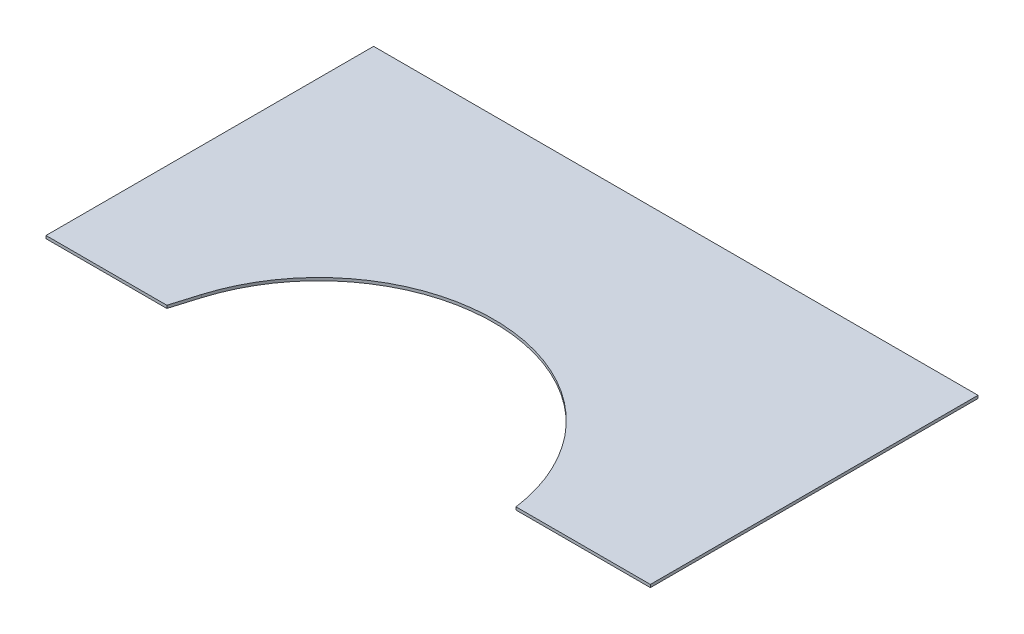
ISO-10303-21;
HEADER;
FILE_DESCRIPTION(('STEP AP214'),'2;1');
FILE_NAME('part.step','',(''),(''),'','','');
FILE_SCHEMA(('AUTOMOTIVE_DESIGN { 1 0 10303 214 1 1 1 1 }'));
ENDSEC;
DATA;
#1=APPLICATION_CONTEXT('core data for automotive mechanical design processes');
#2=APPLICATION_PROTOCOL_DEFINITION('international standard','automotive_design',2000,#1);
#3=PRODUCT_CONTEXT('',#1,'mechanical');
#4=PRODUCT('Part','Part','',(#3));
#5=PRODUCT_RELATED_PRODUCT_CATEGORY('part','',(#4));
#6=PRODUCT_DEFINITION_FORMATION('','',#4);
#7=PRODUCT_DEFINITION_CONTEXT('part definition',#1,'design');
#8=PRODUCT_DEFINITION('design','',#6,#7);
#9=PRODUCT_DEFINITION_SHAPE('','',#8);
#10=(LENGTH_UNIT() NAMED_UNIT(*) SI_UNIT(.MILLI.,.METRE.));
#11=(NAMED_UNIT(*) PLANE_ANGLE_UNIT() SI_UNIT($,.RADIAN.));
#12=(NAMED_UNIT(*) SI_UNIT($,.STERADIAN.) SOLID_ANGLE_UNIT());
#13=UNCERTAINTY_MEASURE_WITH_UNIT(LENGTH_MEASURE(1.E-05),#10,'distance_accuracy_value','');
#14=(GEOMETRIC_REPRESENTATION_CONTEXT(3) GLOBAL_UNCERTAINTY_ASSIGNED_CONTEXT((#13)) GLOBAL_UNIT_ASSIGNED_CONTEXT((#10,
#11,#12)) REPRESENTATION_CONTEXT('',''));
#15=CARTESIAN_POINT('',(0.,0.,0.));
#16=DIRECTION('',(0.,0.,1.));
#17=DIRECTION('',(1.,0.,0.));
#18=AXIS2_PLACEMENT_3D('',#15,#16,#17);
#19=CARTESIAN_POINT('',(0.,3.175,0.));
#20=DIRECTION('',(0.,0.,-1.));
#21=DIRECTION('',(-1.,0.,0.));
#22=AXIS2_PLACEMENT_3D('',#19,#20,#21);
#23=PLANE('',#22);
#24=DIRECTION('',(1.,0.,0.));
#25=VECTOR('',#24,1.);
#26=CARTESIAN_POINT('',(0.,0.,0.));
#27=LINE('',#26,#25);
#28=CARTESIAN_POINT('',(0.,0.,0.));
#29=VERTEX_POINT('',#28);
#30=CARTESIAN_POINT('',(135.832993333816,0.,0.));
#31=VERTEX_POINT('',#30);
#32=EDGE_CURVE('E118',#29,#31,#27,.T.);
#33=ORIENTED_EDGE('',*,*,#32,.T.);
#34=DIRECTION('',(0.,1.,0.));
#35=VECTOR('',#34,1.);
#36=CARTESIAN_POINT('',(135.832993333816,0.,0.));
#37=LINE('',#36,#35);
#38=CARTESIAN_POINT('',(135.832993333816,3.175,0.));
#39=VERTEX_POINT('',#38);
#40=EDGE_CURVE('E106',#31,#39,#37,.T.);
#41=ORIENTED_EDGE('',*,*,#40,.T.);
#42=DIRECTION('',(1.,0.,0.));
#43=VECTOR('',#42,1.);
#44=CARTESIAN_POINT('',(0.,3.175,0.));
#45=LINE('',#44,#43);
#46=CARTESIAN_POINT('',(0.,3.175,0.));
#47=VERTEX_POINT('',#46);
#48=EDGE_CURVE('E92',#47,#39,#45,.T.);
#49=ORIENTED_EDGE('',*,*,#48,.F.);
#50=DIRECTION('',(0.,-1.,0.));
#51=VECTOR('',#50,1.);
#52=CARTESIAN_POINT('',(0.,3.175,0.));
#53=LINE('',#52,#51);
#54=EDGE_CURVE('E47',#47,#29,#53,.T.);
#55=ORIENTED_EDGE('',*,*,#54,.T.);
#56=EDGE_LOOP('',(#33,#41,#49,#55));
#57=FACE_BOUND('',#56,.T.);
#58=ADVANCED_FACE('F39',(#57),#23,.F.);
#59=CARTESIAN_POINT('',(0.,3.175,0.));
#60=DIRECTION('',(1.,0.,0.));
#61=DIRECTION('',(0.,0.,-1.));
#62=AXIS2_PLACEMENT_3D('',#59,#60,#61);
#63=PLANE('',#62);
#64=DIRECTION('',(0.,0.,1.));
#65=VECTOR('',#64,1.);
#66=CARTESIAN_POINT('',(0.,0.,0.));
#67=LINE('',#66,#65);
#68=CARTESIAN_POINT('',(0.,0.,-368.3));
#69=VERTEX_POINT('',#68);
#70=EDGE_CURVE('E127',#69,#29,#67,.T.);
#71=ORIENTED_EDGE('',*,*,#70,.T.);
#72=ORIENTED_EDGE('',*,*,#54,.F.);
#73=DIRECTION('',(0.,0.,1.));
#74=VECTOR('',#73,1.);
#75=CARTESIAN_POINT('',(0.,3.175,0.));
#76=LINE('',#75,#74);
#77=CARTESIAN_POINT('',(0.,3.175,-368.3));
#78=VERTEX_POINT('',#77);
#79=EDGE_CURVE('E132',#78,#47,#76,.T.);
#80=ORIENTED_EDGE('',*,*,#79,.F.);
#81=DIRECTION('',(0.,-1.,0.));
#82=VECTOR('',#81,1.);
#83=CARTESIAN_POINT('',(0.,3.175,-368.3));
#84=LINE('',#83,#82);
#85=EDGE_CURVE('E133',#78,#69,#84,.T.);
#86=ORIENTED_EDGE('',*,*,#85,.T.);
#87=EDGE_LOOP('',(#71,#72,#80,#86));
#88=FACE_BOUND('',#87,.T.);
#89=ADVANCED_FACE('F41',(#88),#63,.F.);
#90=CARTESIAN_POINT('',(528.39099943603,3.175,0.));
#91=VERTEX_POINT('',#90);
#92=CARTESIAN_POINT('',(679.45,3.175,0.));
#93=VERTEX_POINT('',#92);
#94=EDGE_CURVE('E154',#91,#93,#45,.T.);
#95=ORIENTED_EDGE('',*,*,#94,.F.);
#96=DIRECTION('',(0.,1.,0.));
#97=VECTOR('',#96,1.);
#98=CARTESIAN_POINT('',(528.39099943603,0.,0.));
#99=LINE('',#98,#97);
#100=CARTESIAN_POINT('',(528.39099943603,0.,0.));
#101=VERTEX_POINT('',#100);
#102=EDGE_CURVE('E111',#91,#101,#99,.F.);
#103=ORIENTED_EDGE('',*,*,#102,.T.);
#104=CARTESIAN_POINT('',(679.45,0.,0.));
#105=VERTEX_POINT('',#104);
#106=EDGE_CURVE('E124',#101,#105,#27,.T.);
#107=ORIENTED_EDGE('',*,*,#106,.T.);
#108=DIRECTION('',(0.,-1.,0.));
#109=VECTOR('',#108,1.);
#110=CARTESIAN_POINT('',(679.45,3.175,0.));
#111=LINE('',#110,#109);
#112=EDGE_CURVE('E137',#93,#105,#111,.T.);
#113=ORIENTED_EDGE('',*,*,#112,.F.);
#114=EDGE_LOOP('',(#95,#103,#107,#113));
#115=FACE_BOUND('',#114,.T.);
#116=ADVANCED_FACE('F175',(#115),#23,.F.);
#117=CARTESIAN_POINT('',(679.45,3.175,0.));
#118=DIRECTION('',(-1.,0.,0.));
#119=DIRECTION('',(0.,0.,1.));
#120=AXIS2_PLACEMENT_3D('',#117,#118,#119);
#121=PLANE('',#120);
#122=DIRECTION('',(0.,0.,-1.));
#123=VECTOR('',#122,1.);
#124=CARTESIAN_POINT('',(679.45,0.,0.));
#125=LINE('',#124,#123);
#126=CARTESIAN_POINT('',(679.45,0.,-368.3));
#127=VERTEX_POINT('',#126);
#128=EDGE_CURVE('E123',#105,#127,#125,.T.);
#129=ORIENTED_EDGE('',*,*,#128,.T.);
#130=DIRECTION('',(0.,-1.,0.));
#131=VECTOR('',#130,1.);
#132=CARTESIAN_POINT('',(679.45,3.175,-368.3));
#133=LINE('',#132,#131);
#134=CARTESIAN_POINT('',(679.45,3.175,-368.3));
#135=VERTEX_POINT('',#134);
#136=EDGE_CURVE('E135',#135,#127,#133,.T.);
#137=ORIENTED_EDGE('',*,*,#136,.F.);
#138=DIRECTION('',(0.,0.,-1.));
#139=VECTOR('',#138,1.);
#140=CARTESIAN_POINT('',(679.45,3.175,0.));
#141=LINE('',#140,#139);
#142=EDGE_CURVE('E145',#93,#135,#141,.T.);
#143=ORIENTED_EDGE('',*,*,#142,.F.);
#144=ORIENTED_EDGE('',*,*,#112,.T.);
#145=EDGE_LOOP('',(#129,#137,#143,#144));
#146=FACE_BOUND('',#145,.T.);
#147=ADVANCED_FACE('F143',(#146),#121,.F.);
#148=CARTESIAN_POINT('',(0.,3.175,-368.3));
#149=DIRECTION('',(0.,0.,1.));
#150=DIRECTION('',(1.,0.,0.));
#151=AXIS2_PLACEMENT_3D('',#148,#149,#150);
#152=PLANE('',#151);
#153=DIRECTION('',(-1.,0.,0.));
#154=VECTOR('',#153,1.);
#155=CARTESIAN_POINT('',(0.,0.,-368.3));
#156=LINE('',#155,#154);
#157=EDGE_CURVE('E84',#127,#69,#156,.T.);
#158=ORIENTED_EDGE('',*,*,#157,.T.);
#159=ORIENTED_EDGE('',*,*,#85,.F.);
#160=DIRECTION('',(-1.,0.,0.));
#161=VECTOR('',#160,1.);
#162=CARTESIAN_POINT('',(0.,3.175,-368.3));
#163=LINE('',#162,#161);
#164=EDGE_CURVE('E63',#135,#78,#163,.T.);
#165=ORIENTED_EDGE('',*,*,#164,.F.);
#166=ORIENTED_EDGE('',*,*,#136,.T.);
#167=EDGE_LOOP('',(#158,#159,#165,#166));
#168=FACE_BOUND('',#167,.T.);
#169=ADVANCED_FACE('F158',(#168),#152,.F.);
#170=CARTESIAN_POINT('',(0.,3.175,0.));
#171=DIRECTION('',(0.,-1.,0.));
#172=DIRECTION('',(0.,0.,-1.));
#173=AXIS2_PLACEMENT_3D('',#170,#171,#172);
#174=PLANE('',#173);
#175=ORIENTED_EDGE('',*,*,#48,.T.);
#176=DIRECTION('',(-0.289313321980123,0.,0.957234454940286));
#177=VECTOR('',#176,1.);
#178=CARTESIAN_POINT('',(135.832993333816,3.175,0.));
#179=LINE('',#178,#177);
#180=CARTESIAN_POINT('',(144.943397545011,3.175,-30.1430737779423));
#181=VERTEX_POINT('',#180);
#182=EDGE_CURVE('E109',#181,#39,#179,.T.);
#183=ORIENTED_EDGE('',*,*,#182,.F.);
#184=CARTESIAN_POINT('',(333.375000000006,3.175,26.8082536538448));
#185=DIRECTION('',(0.,1.,0.));
#186=DIRECTION('',(0.,0.,1.));
#187=AXIS2_PLACEMENT_3D('',#184,#185,#186);
#188=CIRCLE('',#187,196.85);
#189=EDGE_CURVE('E160',#91,#181,#188,.T.);
#190=ORIENTED_EDGE('',*,*,#189,.F.);
#191=ORIENTED_EDGE('',*,*,#94,.T.);
#192=ORIENTED_EDGE('',*,*,#142,.T.);
#193=ORIENTED_EDGE('',*,*,#164,.T.);
#194=ORIENTED_EDGE('',*,*,#79,.T.);
#195=EDGE_LOOP('',(#175,#183,#190,#191,#192,#193,#194));
#196=FACE_BOUND('',#195,.T.);
#197=ADVANCED_FACE('F156',(#196),#174,.F.);
#198=CARTESIAN_POINT('',(0.,0.,0.));
#199=DIRECTION('',(0.,-1.,0.));
#200=DIRECTION('',(0.,0.,-1.));
#201=AXIS2_PLACEMENT_3D('',#198,#199,#200);
#202=PLANE('',#201);
#203=DIRECTION('',(-0.289313321980123,0.,0.957234454940286));
#204=VECTOR('',#203,1.);
#205=CARTESIAN_POINT('',(135.832993333816,0.,0.));
#206=LINE('',#205,#204);
#207=CARTESIAN_POINT('',(144.943397545011,0.,-30.1430737779423));
#208=VERTEX_POINT('',#207);
#209=EDGE_CURVE('E54',#208,#31,#206,.T.);
#210=ORIENTED_EDGE('',*,*,#209,.T.);
#211=ORIENTED_EDGE('',*,*,#32,.F.);
#212=ORIENTED_EDGE('',*,*,#70,.F.);
#213=ORIENTED_EDGE('',*,*,#157,.F.);
#214=ORIENTED_EDGE('',*,*,#128,.F.);
#215=ORIENTED_EDGE('',*,*,#106,.F.);
#216=CARTESIAN_POINT('',(333.375000000006,0.,26.8082536538448));
#217=DIRECTION('',(0.,-1.,0.));
#218=DIRECTION('',(0.,0.,-1.));
#219=AXIS2_PLACEMENT_3D('',#216,#217,#218);
#220=CIRCLE('',#219,196.85);
#221=EDGE_CURVE('E11',#208,#101,#220,.T.);
#222=ORIENTED_EDGE('',*,*,#221,.F.);
#223=EDGE_LOOP('',(#210,#211,#212,#213,#214,#215,#222));
#224=FACE_BOUND('',#223,.T.);
#225=ADVANCED_FACE('F116',(#224),#202,.T.);
#226=CARTESIAN_POINT('',(333.375000000006,0.,26.8082536538448));
#227=DIRECTION('',(0.,1.,0.));
#228=DIRECTION('',(0.,0.,1.));
#229=AXIS2_PLACEMENT_3D('',#226,#227,#228);
#230=CYLINDRICAL_SURFACE('',#229,196.85);
#231=ORIENTED_EDGE('',*,*,#189,.T.);
#232=DIRECTION('',(0.,1.,0.));
#233=VECTOR('',#232,1.);
#234=CARTESIAN_POINT('',(144.943397545011,0.,-30.1430737779423));
#235=LINE('',#234,#233);
#236=EDGE_CURVE('E112',#208,#181,#235,.T.);
#237=ORIENTED_EDGE('',*,*,#236,.F.);
#238=ORIENTED_EDGE('',*,*,#221,.T.);
#239=ORIENTED_EDGE('',*,*,#102,.F.);
#240=EDGE_LOOP('',(#231,#237,#238,#239));
#241=FACE_BOUND('',#240,.T.);
#242=ADVANCED_FACE('F164',(#241),#230,.F.);
#243=CARTESIAN_POINT('',(135.832993333816,0.,0.));
#244=DIRECTION('',(-0.957234454940285,0.,-0.289313321980123));
#245=DIRECTION('',(-0.289313321980123,0.,0.957234454940286));
#246=AXIS2_PLACEMENT_3D('',#243,#244,#245);
#247=PLANE('',#246);
#248=ORIENTED_EDGE('',*,*,#182,.T.);
#249=ORIENTED_EDGE('',*,*,#40,.F.);
#250=ORIENTED_EDGE('',*,*,#209,.F.);
#251=ORIENTED_EDGE('',*,*,#236,.T.);
#252=EDGE_LOOP('',(#248,#249,#250,#251));
#253=FACE_BOUND('',#252,.T.);
#254=ADVANCED_FACE('F107',(#253),#247,.F.);
#255=CLOSED_SHELL('',(#58,#89,#116,#147,#169,#197,#225,#242,#254));
#256=MANIFOLD_SOLID_BREP('B2',#255);
#257=ADVANCED_BREP_SHAPE_REPRESENTATION('',(#18,#256),#14);
#258=SHAPE_DEFINITION_REPRESENTATION(#9,#257);
ENDSEC;
END-ISO-10303-21;
